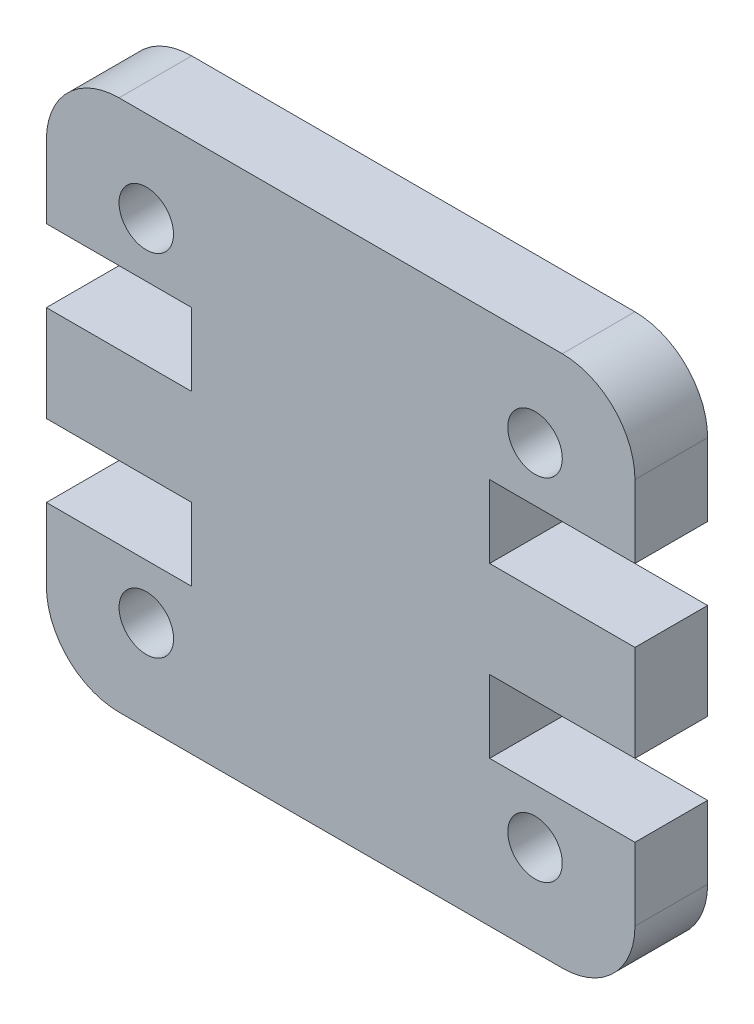
ISO-10303-21;
HEADER;
FILE_DESCRIPTION(('STEP AP214'),'2;1');
FILE_NAME('part.step','',(''),(''),'','','');
FILE_SCHEMA(('AUTOMOTIVE_DESIGN { 1 0 10303 214 1 1 1 1 }'));
ENDSEC;
DATA;
#1=APPLICATION_CONTEXT('core data for automotive mechanical design processes');
#2=APPLICATION_PROTOCOL_DEFINITION('international standard','automotive_design',2000,#1);
#3=PRODUCT_CONTEXT('',#1,'mechanical');
#4=PRODUCT('Part','Part','',(#3));
#5=PRODUCT_RELATED_PRODUCT_CATEGORY('part','',(#4));
#6=PRODUCT_DEFINITION_FORMATION('','',#4);
#7=PRODUCT_DEFINITION_CONTEXT('part definition',#1,'design');
#8=PRODUCT_DEFINITION('design','',#6,#7);
#9=PRODUCT_DEFINITION_SHAPE('','',#8);
#10=(LENGTH_UNIT() NAMED_UNIT(*) SI_UNIT(.MILLI.,.METRE.));
#11=(NAMED_UNIT(*) PLANE_ANGLE_UNIT() SI_UNIT($,.RADIAN.));
#12=(NAMED_UNIT(*) SI_UNIT($,.STERADIAN.) SOLID_ANGLE_UNIT());
#13=UNCERTAINTY_MEASURE_WITH_UNIT(LENGTH_MEASURE(1.E-05),#10,'distance_accuracy_value','');
#14=(GEOMETRIC_REPRESENTATION_CONTEXT(3) GLOBAL_UNCERTAINTY_ASSIGNED_CONTEXT((#13)) GLOBAL_UNIT_ASSIGNED_CONTEXT((#10,
#11,#12)) REPRESENTATION_CONTEXT('',''));
#15=CARTESIAN_POINT('',(0.,0.,0.));
#16=DIRECTION('',(0.,0.,1.));
#17=DIRECTION('',(1.,0.,0.));
#18=AXIS2_PLACEMENT_3D('',#15,#16,#17);
#19=CARTESIAN_POINT('',(14.2,2.,2.));
#20=DIRECTION('',(0.,0.,-1.));
#21=DIRECTION('',(-1.,0.,0.));
#22=AXIS2_PLACEMENT_3D('',#19,#20,#21);
#23=PLANE('',#22);
#24=CARTESIAN_POINT('',(13.4499999999986,12.1450000000001,2.));
#25=DIRECTION('',(0.,0.,1.));
#26=DIRECTION('',(1.,0.,0.));
#27=AXIS2_PLACEMENT_3D('',#24,#25,#26);
#28=CIRCLE('',#27,0.750000000000002);
#29=CARTESIAN_POINT('',(14.1999999999986,12.1450000000001,2.));
#30=VERTEX_POINT('',#29);
#31=EDGE_CURVE('E448',#30,#30,#28,.T.);
#32=ORIENTED_EDGE('',*,*,#31,.F.);
#33=EDGE_LOOP('',(#32));
#34=FACE_BOUND('',#33,.T.);
#35=CARTESIAN_POINT('',(13.4499999999986,2.4999999999999,2.));
#36=DIRECTION('',(0.,0.,1.));
#37=DIRECTION('',(-1.,0.,0.));
#38=AXIS2_PLACEMENT_3D('',#35,#36,#37);
#39=CIRCLE('',#38,0.750000000000002);
#40=CARTESIAN_POINT('',(12.6999999999986,2.4999999999999,2.));
#41=VERTEX_POINT('',#40);
#42=EDGE_CURVE('E230',#41,#41,#39,.T.);
#43=ORIENTED_EDGE('',*,*,#42,.F.);
#44=EDGE_LOOP('',(#43));
#45=FACE_BOUND('',#44,.T.);
#46=CARTESIAN_POINT('',(14.2,2.,2.));
#47=DIRECTION('',(0.,0.,1.));
#48=DIRECTION('',(-1.,0.,0.));
#49=AXIS2_PLACEMENT_3D('',#46,#47,#48);
#50=CIRCLE('',#49,2.);
#51=CARTESIAN_POINT('',(14.2,0.,2.));
#52=VERTEX_POINT('',#51);
#53=CARTESIAN_POINT('',(16.2,2.,2.));
#54=VERTEX_POINT('',#53);
#55=EDGE_CURVE('E273',#52,#54,#50,.T.);
#56=ORIENTED_EDGE('',*,*,#55,.T.);
#57=DIRECTION('',(0.,1.,0.));
#58=VECTOR('',#57,1.);
#59=CARTESIAN_POINT('',(16.2,4.,2.));
#60=LINE('',#59,#58);
#61=CARTESIAN_POINT('',(16.2,4.,2.));
#62=VERTEX_POINT('',#61);
#63=EDGE_CURVE('E141',#54,#62,#60,.T.);
#64=ORIENTED_EDGE('',*,*,#63,.T.);
#65=DIRECTION('',(-1.,0.,0.));
#66=VECTOR('',#65,1.);
#67=CARTESIAN_POINT('',(12.2,4.,2.));
#68=LINE('',#67,#66);
#69=CARTESIAN_POINT('',(12.2,4.,2.));
#70=VERTEX_POINT('',#69);
#71=EDGE_CURVE('E336',#62,#70,#68,.T.);
#72=ORIENTED_EDGE('',*,*,#71,.T.);
#73=DIRECTION('',(0.,1.,0.));
#74=VECTOR('',#73,1.);
#75=CARTESIAN_POINT('',(12.2,6.00000000000001,2.));
#76=LINE('',#75,#74);
#77=CARTESIAN_POINT('',(12.2,6.00000000000001,2.));
#78=VERTEX_POINT('',#77);
#79=EDGE_CURVE('E355',#70,#78,#76,.T.);
#80=ORIENTED_EDGE('',*,*,#79,.T.);
#81=DIRECTION('',(1.,0.,0.));
#82=VECTOR('',#81,1.);
#83=CARTESIAN_POINT('',(16.2,6.00000000000001,2.));
#84=LINE('',#83,#82);
#85=CARTESIAN_POINT('',(16.2,6.00000000000001,2.));
#86=VERTEX_POINT('',#85);
#87=EDGE_CURVE('E352',#78,#86,#84,.T.);
#88=ORIENTED_EDGE('',*,*,#87,.T.);
#89=DIRECTION('',(0.,1.,0.));
#90=VECTOR('',#89,1.);
#91=CARTESIAN_POINT('',(16.2,8.64499999999999,2.));
#92=LINE('',#91,#90);
#93=CARTESIAN_POINT('',(16.2,8.64499999999999,2.));
#94=VERTEX_POINT('',#93);
#95=EDGE_CURVE('E354',#86,#94,#92,.T.);
#96=ORIENTED_EDGE('',*,*,#95,.T.);
#97=DIRECTION('',(-1.,0.,0.));
#98=VECTOR('',#97,1.);
#99=CARTESIAN_POINT('',(16.2,8.64499999999999,2.));
#100=LINE('',#99,#98);
#101=CARTESIAN_POINT('',(12.2,8.64499999999999,2.));
#102=VERTEX_POINT('',#101);
#103=EDGE_CURVE('E357',#94,#102,#100,.T.);
#104=ORIENTED_EDGE('',*,*,#103,.T.);
#105=DIRECTION('',(0.,1.,0.));
#106=VECTOR('',#105,1.);
#107=CARTESIAN_POINT('',(12.2,8.64499999999999,2.));
#108=LINE('',#107,#106);
#109=CARTESIAN_POINT('',(12.2,10.645,2.));
#110=VERTEX_POINT('',#109);
#111=EDGE_CURVE('E363',#102,#110,#108,.T.);
#112=ORIENTED_EDGE('',*,*,#111,.T.);
#113=DIRECTION('',(1.,0.,0.));
#114=VECTOR('',#113,1.);
#115=CARTESIAN_POINT('',(12.2,10.645,2.));
#116=LINE('',#115,#114);
#117=CARTESIAN_POINT('',(16.2,10.645,2.));
#118=VERTEX_POINT('',#117);
#119=EDGE_CURVE('E365',#110,#118,#116,.T.);
#120=ORIENTED_EDGE('',*,*,#119,.T.);
#121=DIRECTION('',(0.,1.,0.));
#122=VECTOR('',#121,1.);
#123=CARTESIAN_POINT('',(16.2,10.645,2.));
#124=LINE('',#123,#122);
#125=CARTESIAN_POINT('',(16.2,12.645,2.));
#126=VERTEX_POINT('',#125);
#127=EDGE_CURVE('E367',#118,#126,#124,.T.);
#128=ORIENTED_EDGE('',*,*,#127,.T.);
#129=CARTESIAN_POINT('',(14.2,12.645,2.));
#130=DIRECTION('',(0.,0.,1.));
#131=DIRECTION('',(1.,0.,0.));
#132=AXIS2_PLACEMENT_3D('',#129,#130,#131);
#133=CIRCLE('',#132,2.);
#134=CARTESIAN_POINT('',(14.2,14.645,2.));
#135=VERTEX_POINT('',#134);
#136=EDGE_CURVE('E369',#126,#135,#133,.T.);
#137=ORIENTED_EDGE('',*,*,#136,.T.);
#138=DIRECTION('',(-1.,0.,0.));
#139=VECTOR('',#138,1.);
#140=CARTESIAN_POINT('',(2.,14.645,2.));
#141=LINE('',#140,#139);
#142=CARTESIAN_POINT('',(2.,14.645,2.));
#143=VERTEX_POINT('',#142);
#144=EDGE_CURVE('E371',#135,#143,#141,.T.);
#145=ORIENTED_EDGE('',*,*,#144,.T.);
#146=CARTESIAN_POINT('',(2.,12.645,2.));
#147=DIRECTION('',(0.,0.,1.));
#148=DIRECTION('',(-1.,0.,0.));
#149=AXIS2_PLACEMENT_3D('',#146,#147,#148);
#150=CIRCLE('',#149,2.);
#151=CARTESIAN_POINT('',(0.,12.645,2.));
#152=VERTEX_POINT('',#151);
#153=EDGE_CURVE('E373',#143,#152,#150,.T.);
#154=ORIENTED_EDGE('',*,*,#153,.T.);
#155=DIRECTION('',(0.,-1.,0.));
#156=VECTOR('',#155,1.);
#157=CARTESIAN_POINT('',(0.,10.645,2.));
#158=LINE('',#157,#156);
#159=CARTESIAN_POINT('',(0.,10.645,2.));
#160=VERTEX_POINT('',#159);
#161=EDGE_CURVE('E375',#152,#160,#158,.T.);
#162=ORIENTED_EDGE('',*,*,#161,.T.);
#163=DIRECTION('',(1.,0.,0.));
#164=VECTOR('',#163,1.);
#165=CARTESIAN_POINT('',(4.,10.645,2.));
#166=LINE('',#165,#164);
#167=CARTESIAN_POINT('',(4.,10.645,2.));
#168=VERTEX_POINT('',#167);
#169=EDGE_CURVE('E377',#160,#168,#166,.T.);
#170=ORIENTED_EDGE('',*,*,#169,.T.);
#171=DIRECTION('',(0.,-1.,0.));
#172=VECTOR('',#171,1.);
#173=CARTESIAN_POINT('',(4.,8.64499999999999,2.));
#174=LINE('',#173,#172);
#175=CARTESIAN_POINT('',(4.,8.64499999999999,2.));
#176=VERTEX_POINT('',#175);
#177=EDGE_CURVE('E379',#168,#176,#174,.T.);
#178=ORIENTED_EDGE('',*,*,#177,.T.);
#179=DIRECTION('',(-1.,0.,0.));
#180=VECTOR('',#179,1.);
#181=CARTESIAN_POINT('',(0.,8.64499999999999,2.));
#182=LINE('',#181,#180);
#183=CARTESIAN_POINT('',(0.,8.64499999999999,2.));
#184=VERTEX_POINT('',#183);
#185=EDGE_CURVE('E381',#176,#184,#182,.T.);
#186=ORIENTED_EDGE('',*,*,#185,.T.);
#187=DIRECTION('',(0.,-1.,0.));
#188=VECTOR('',#187,1.);
#189=CARTESIAN_POINT('',(0.,8.64499999999999,2.));
#190=LINE('',#189,#188);
#191=CARTESIAN_POINT('',(0.,6.00000000000003,2.));
#192=VERTEX_POINT('',#191);
#193=EDGE_CURVE('E383',#184,#192,#190,.T.);
#194=ORIENTED_EDGE('',*,*,#193,.T.);
#195=DIRECTION('',(1.,0.,0.));
#196=VECTOR('',#195,1.);
#197=CARTESIAN_POINT('',(0.,6.00000000000003,2.));
#198=LINE('',#197,#196);
#199=CARTESIAN_POINT('',(4.00000000000003,6.00000000000003,2.));
#200=VERTEX_POINT('',#199);
#201=EDGE_CURVE('E385',#192,#200,#198,.T.);
#202=ORIENTED_EDGE('',*,*,#201,.T.);
#203=DIRECTION('',(0.,-1.,0.));
#204=VECTOR('',#203,1.);
#205=CARTESIAN_POINT('',(4.00000000000003,6.00000000000003,2.));
#206=LINE('',#205,#204);
#207=CARTESIAN_POINT('',(4.00000000000003,4.00000000000002,2.));
#208=VERTEX_POINT('',#207);
#209=EDGE_CURVE('E387',#200,#208,#206,.T.);
#210=ORIENTED_EDGE('',*,*,#209,.T.);
#211=DIRECTION('',(-1.,0.,0.));
#212=VECTOR('',#211,1.);
#213=CARTESIAN_POINT('',(4.00000000000003,4.00000000000002,2.));
#214=LINE('',#213,#212);
#215=CARTESIAN_POINT('',(0.,4.00000000000003,2.));
#216=VERTEX_POINT('',#215);
#217=EDGE_CURVE('E208',#208,#216,#214,.T.);
#218=ORIENTED_EDGE('',*,*,#217,.T.);
#219=DIRECTION('',(0.,-1.,0.));
#220=VECTOR('',#219,1.);
#221=CARTESIAN_POINT('',(0.,4.00000000000003,2.));
#222=LINE('',#221,#220);
#223=CARTESIAN_POINT('',(0.,2.00000000000003,2.));
#224=VERTEX_POINT('',#223);
#225=EDGE_CURVE('E202',#216,#224,#222,.T.);
#226=ORIENTED_EDGE('',*,*,#225,.T.);
#227=CARTESIAN_POINT('',(2.,2.,2.));
#228=DIRECTION('',(0.,0.,1.));
#229=DIRECTION('',(1.,0.,0.));
#230=AXIS2_PLACEMENT_3D('',#227,#228,#229);
#231=CIRCLE('',#230,2.);
#232=CARTESIAN_POINT('',(2.,0.,2.));
#233=VERTEX_POINT('',#232);
#234=EDGE_CURVE('E206',#224,#233,#231,.T.);
#235=ORIENTED_EDGE('',*,*,#234,.T.);
#236=DIRECTION('',(1.,0.,0.));
#237=VECTOR('',#236,1.);
#238=CARTESIAN_POINT('',(2.,0.,2.));
#239=LINE('',#238,#237);
#240=EDGE_CURVE('E50',#233,#52,#239,.T.);
#241=ORIENTED_EDGE('',*,*,#240,.T.);
#242=EDGE_LOOP('',(#56,#64,#72,#80,#88,#96,#104,#112,#120,#128,#137,#145,#154,#162,#170,#178,
#186,#194,#202,#210,#218,#226,#235,#241));
#243=FACE_BOUND('',#242,.T.);
#244=CARTESIAN_POINT('',(2.75000000000139,12.1450000000001,2.));
#245=DIRECTION('',(0.,0.,1.));
#246=DIRECTION('',(-1.,0.,0.));
#247=AXIS2_PLACEMENT_3D('',#244,#245,#246);
#248=CIRCLE('',#247,0.750000000000001);
#249=CARTESIAN_POINT('',(2.00000000000139,12.1450000000001,2.));
#250=VERTEX_POINT('',#249);
#251=EDGE_CURVE('E454',#250,#250,#248,.T.);
#252=ORIENTED_EDGE('',*,*,#251,.F.);
#253=EDGE_LOOP('',(#252));
#254=FACE_BOUND('',#253,.T.);
#255=CARTESIAN_POINT('',(2.75000000000139,2.4999999999999,2.));
#256=DIRECTION('',(0.,0.,1.));
#257=DIRECTION('',(1.,0.,0.));
#258=AXIS2_PLACEMENT_3D('',#255,#256,#257);
#259=CIRCLE('',#258,0.75);
#260=CARTESIAN_POINT('',(3.50000000000139,2.4999999999999,2.));
#261=VERTEX_POINT('',#260);
#262=EDGE_CURVE('E439',#261,#261,#259,.T.);
#263=ORIENTED_EDGE('',*,*,#262,.F.);
#264=EDGE_LOOP('',(#263));
#265=FACE_BOUND('',#264,.T.);
#266=ADVANCED_FACE('F33',(#34,#45,#243,#254,#265),#23,.F.);
#267=CARTESIAN_POINT('',(14.2,2.,0.));
#268=DIRECTION('',(0.,0.,-1.));
#269=DIRECTION('',(-1.,0.,0.));
#270=AXIS2_PLACEMENT_3D('',#267,#268,#269);
#271=PLANE('',#270);
#272=CARTESIAN_POINT('',(13.4499999999986,12.1450000000001,0.));
#273=DIRECTION('',(0.,0.,1.));
#274=DIRECTION('',(1.,0.,0.));
#275=AXIS2_PLACEMENT_3D('',#272,#273,#274);
#276=CIRCLE('',#275,0.750000000000002);
#277=CARTESIAN_POINT('',(14.1999999999986,12.1450000000001,0.));
#278=VERTEX_POINT('',#277);
#279=EDGE_CURVE('E445',#278,#278,#276,.T.);
#280=ORIENTED_EDGE('',*,*,#279,.T.);
#281=EDGE_LOOP('',(#280));
#282=FACE_BOUND('',#281,.T.);
#283=CARTESIAN_POINT('',(13.4499999999986,2.4999999999999,0.));
#284=DIRECTION('',(0.,0.,1.));
#285=DIRECTION('',(-1.,0.,0.));
#286=AXIS2_PLACEMENT_3D('',#283,#284,#285);
#287=CIRCLE('',#286,0.750000000000002);
#288=CARTESIAN_POINT('',(12.6999999999986,2.4999999999999,0.));
#289=VERTEX_POINT('',#288);
#290=EDGE_CURVE('E457',#289,#289,#287,.T.);
#291=ORIENTED_EDGE('',*,*,#290,.T.);
#292=EDGE_LOOP('',(#291));
#293=FACE_BOUND('',#292,.T.);
#294=CARTESIAN_POINT('',(14.2,2.,0.));
#295=DIRECTION('',(0.,0.,1.));
#296=DIRECTION('',(-1.,0.,0.));
#297=AXIS2_PLACEMENT_3D('',#294,#295,#296);
#298=CIRCLE('',#297,2.);
#299=CARTESIAN_POINT('',(14.2,0.,0.));
#300=VERTEX_POINT('',#299);
#301=CARTESIAN_POINT('',(16.2,2.,0.));
#302=VERTEX_POINT('',#301);
#303=EDGE_CURVE('E226',#300,#302,#298,.T.);
#304=ORIENTED_EDGE('',*,*,#303,.F.);
#305=DIRECTION('',(1.,0.,0.));
#306=VECTOR('',#305,1.);
#307=CARTESIAN_POINT('',(2.,0.,0.));
#308=LINE('',#307,#306);
#309=CARTESIAN_POINT('',(2.,0.,0.));
#310=VERTEX_POINT('',#309);
#311=EDGE_CURVE('E133',#310,#300,#308,.T.);
#312=ORIENTED_EDGE('',*,*,#311,.F.);
#313=CARTESIAN_POINT('',(2.,2.,0.));
#314=DIRECTION('',(0.,0.,1.));
#315=DIRECTION('',(1.,0.,0.));
#316=AXIS2_PLACEMENT_3D('',#313,#314,#315);
#317=CIRCLE('',#316,2.);
#318=CARTESIAN_POINT('',(0.,2.00000000000003,0.));
#319=VERTEX_POINT('',#318);
#320=EDGE_CURVE('E127',#319,#310,#317,.T.);
#321=ORIENTED_EDGE('',*,*,#320,.F.);
#322=DIRECTION('',(0.,-1.,0.));
#323=VECTOR('',#322,1.);
#324=CARTESIAN_POINT('',(0.,4.00000000000003,0.));
#325=LINE('',#324,#323);
#326=CARTESIAN_POINT('',(0.,4.00000000000003,0.));
#327=VERTEX_POINT('',#326);
#328=EDGE_CURVE('E216',#327,#319,#325,.T.);
#329=ORIENTED_EDGE('',*,*,#328,.F.);
#330=DIRECTION('',(-1.,0.,0.));
#331=VECTOR('',#330,1.);
#332=CARTESIAN_POINT('',(4.00000000000003,4.00000000000002,0.));
#333=LINE('',#332,#331);
#334=CARTESIAN_POINT('',(4.00000000000003,4.00000000000002,0.));
#335=VERTEX_POINT('',#334);
#336=EDGE_CURVE('E268',#335,#327,#333,.T.);
#337=ORIENTED_EDGE('',*,*,#336,.F.);
#338=DIRECTION('',(0.,-1.,0.));
#339=VECTOR('',#338,1.);
#340=CARTESIAN_POINT('',(4.00000000000003,6.00000000000003,0.));
#341=LINE('',#340,#339);
#342=CARTESIAN_POINT('',(4.00000000000003,6.00000000000003,0.));
#343=VERTEX_POINT('',#342);
#344=EDGE_CURVE('E266',#343,#335,#341,.T.);
#345=ORIENTED_EDGE('',*,*,#344,.F.);
#346=DIRECTION('',(1.,0.,0.));
#347=VECTOR('',#346,1.);
#348=CARTESIAN_POINT('',(0.,6.00000000000003,0.));
#349=LINE('',#348,#347);
#350=CARTESIAN_POINT('',(0.,6.00000000000003,0.));
#351=VERTEX_POINT('',#350);
#352=EDGE_CURVE('E264',#351,#343,#349,.T.);
#353=ORIENTED_EDGE('',*,*,#352,.F.);
#354=DIRECTION('',(0.,-1.,0.));
#355=VECTOR('',#354,1.);
#356=CARTESIAN_POINT('',(0.,8.64499999999999,0.));
#357=LINE('',#356,#355);
#358=CARTESIAN_POINT('',(0.,8.64499999999999,0.));
#359=VERTEX_POINT('',#358);
#360=EDGE_CURVE('E262',#359,#351,#357,.T.);
#361=ORIENTED_EDGE('',*,*,#360,.F.);
#362=DIRECTION('',(-1.,0.,0.));
#363=VECTOR('',#362,1.);
#364=CARTESIAN_POINT('',(0.,8.64499999999999,0.));
#365=LINE('',#364,#363);
#366=CARTESIAN_POINT('',(4.,8.64499999999999,0.));
#367=VERTEX_POINT('',#366);
#368=EDGE_CURVE('E260',#367,#359,#365,.T.);
#369=ORIENTED_EDGE('',*,*,#368,.F.);
#370=DIRECTION('',(0.,-1.,0.));
#371=VECTOR('',#370,1.);
#372=CARTESIAN_POINT('',(4.,8.64499999999999,0.));
#373=LINE('',#372,#371);
#374=CARTESIAN_POINT('',(4.,10.645,0.));
#375=VERTEX_POINT('',#374);
#376=EDGE_CURVE('E258',#375,#367,#373,.T.);
#377=ORIENTED_EDGE('',*,*,#376,.F.);
#378=DIRECTION('',(1.,0.,0.));
#379=VECTOR('',#378,1.);
#380=CARTESIAN_POINT('',(4.,10.645,0.));
#381=LINE('',#380,#379);
#382=CARTESIAN_POINT('',(0.,10.645,0.));
#383=VERTEX_POINT('',#382);
#384=EDGE_CURVE('E256',#383,#375,#381,.T.);
#385=ORIENTED_EDGE('',*,*,#384,.F.);
#386=DIRECTION('',(0.,-1.,0.));
#387=VECTOR('',#386,1.);
#388=CARTESIAN_POINT('',(0.,10.645,0.));
#389=LINE('',#388,#387);
#390=CARTESIAN_POINT('',(0.,12.645,0.));
#391=VERTEX_POINT('',#390);
#392=EDGE_CURVE('E254',#391,#383,#389,.T.);
#393=ORIENTED_EDGE('',*,*,#392,.F.);
#394=CARTESIAN_POINT('',(2.,12.645,0.));
#395=DIRECTION('',(0.,0.,1.));
#396=DIRECTION('',(-1.,0.,0.));
#397=AXIS2_PLACEMENT_3D('',#394,#395,#396);
#398=CIRCLE('',#397,2.);
#399=CARTESIAN_POINT('',(2.,14.645,0.));
#400=VERTEX_POINT('',#399);
#401=EDGE_CURVE('E252',#400,#391,#398,.T.);
#402=ORIENTED_EDGE('',*,*,#401,.F.);
#403=DIRECTION('',(-1.,0.,0.));
#404=VECTOR('',#403,1.);
#405=CARTESIAN_POINT('',(2.,14.645,0.));
#406=LINE('',#405,#404);
#407=CARTESIAN_POINT('',(14.2,14.645,0.));
#408=VERTEX_POINT('',#407);
#409=EDGE_CURVE('E250',#408,#400,#406,.T.);
#410=ORIENTED_EDGE('',*,*,#409,.F.);
#411=CARTESIAN_POINT('',(14.2,12.645,0.));
#412=DIRECTION('',(0.,0.,1.));
#413=DIRECTION('',(1.,0.,0.));
#414=AXIS2_PLACEMENT_3D('',#411,#412,#413);
#415=CIRCLE('',#414,2.);
#416=CARTESIAN_POINT('',(16.2,12.645,0.));
#417=VERTEX_POINT('',#416);
#418=EDGE_CURVE('E248',#417,#408,#415,.T.);
#419=ORIENTED_EDGE('',*,*,#418,.F.);
#420=DIRECTION('',(0.,1.,0.));
#421=VECTOR('',#420,1.);
#422=CARTESIAN_POINT('',(16.2,10.645,0.));
#423=LINE('',#422,#421);
#424=CARTESIAN_POINT('',(16.2,10.645,0.));
#425=VERTEX_POINT('',#424);
#426=EDGE_CURVE('E246',#425,#417,#423,.T.);
#427=ORIENTED_EDGE('',*,*,#426,.F.);
#428=DIRECTION('',(1.,0.,0.));
#429=VECTOR('',#428,1.);
#430=CARTESIAN_POINT('',(12.2,10.645,0.));
#431=LINE('',#430,#429);
#432=CARTESIAN_POINT('',(12.2,10.645,0.));
#433=VERTEX_POINT('',#432);
#434=EDGE_CURVE('E244',#433,#425,#431,.T.);
#435=ORIENTED_EDGE('',*,*,#434,.F.);
#436=DIRECTION('',(0.,1.,0.));
#437=VECTOR('',#436,1.);
#438=CARTESIAN_POINT('',(12.2,8.64499999999999,0.));
#439=LINE('',#438,#437);
#440=CARTESIAN_POINT('',(12.2,8.64499999999999,0.));
#441=VERTEX_POINT('',#440);
#442=EDGE_CURVE('E242',#441,#433,#439,.T.);
#443=ORIENTED_EDGE('',*,*,#442,.F.);
#444=DIRECTION('',(-1.,0.,0.));
#445=VECTOR('',#444,1.);
#446=CARTESIAN_POINT('',(16.2,8.64499999999999,0.));
#447=LINE('',#446,#445);
#448=CARTESIAN_POINT('',(16.2,8.64499999999999,0.));
#449=VERTEX_POINT('',#448);
#450=EDGE_CURVE('E240',#449,#441,#447,.T.);
#451=ORIENTED_EDGE('',*,*,#450,.F.);
#452=DIRECTION('',(0.,1.,0.));
#453=VECTOR('',#452,1.);
#454=CARTESIAN_POINT('',(16.2,8.64499999999999,0.));
#455=LINE('',#454,#453);
#456=CARTESIAN_POINT('',(16.2,6.00000000000001,0.));
#457=VERTEX_POINT('',#456);
#458=EDGE_CURVE('E238',#457,#449,#455,.T.);
#459=ORIENTED_EDGE('',*,*,#458,.F.);
#460=DIRECTION('',(1.,0.,0.));
#461=VECTOR('',#460,1.);
#462=CARTESIAN_POINT('',(16.2,6.00000000000001,0.));
#463=LINE('',#462,#461);
#464=CARTESIAN_POINT('',(12.2,6.00000000000001,0.));
#465=VERTEX_POINT('',#464);
#466=EDGE_CURVE('E236',#465,#457,#463,.T.);
#467=ORIENTED_EDGE('',*,*,#466,.F.);
#468=DIRECTION('',(0.,1.,0.));
#469=VECTOR('',#468,1.);
#470=CARTESIAN_POINT('',(12.2,6.00000000000001,0.));
#471=LINE('',#470,#469);
#472=CARTESIAN_POINT('',(12.2,4.,0.));
#473=VERTEX_POINT('',#472);
#474=EDGE_CURVE('E234',#473,#465,#471,.T.);
#475=ORIENTED_EDGE('',*,*,#474,.F.);
#476=DIRECTION('',(-1.,0.,0.));
#477=VECTOR('',#476,1.);
#478=CARTESIAN_POINT('',(12.2,4.,0.));
#479=LINE('',#478,#477);
#480=CARTESIAN_POINT('',(16.2,4.,0.));
#481=VERTEX_POINT('',#480);
#482=EDGE_CURVE('E232',#481,#473,#479,.T.);
#483=ORIENTED_EDGE('',*,*,#482,.F.);
#484=DIRECTION('',(0.,1.,0.));
#485=VECTOR('',#484,1.);
#486=CARTESIAN_POINT('',(16.2,4.,0.));
#487=LINE('',#486,#485);
#488=EDGE_CURVE('E229',#302,#481,#487,.T.);
#489=ORIENTED_EDGE('',*,*,#488,.F.);
#490=EDGE_LOOP('',(#304,#312,#321,#329,#337,#345,#353,#361,#369,#377,#385,#393,#402,#410,#419,
#427,#435,#443,#451,#459,#467,#475,#483,#489));
#491=FACE_BOUND('',#490,.T.);
#492=CARTESIAN_POINT('',(2.75000000000139,12.1450000000001,0.));
#493=DIRECTION('',(0.,0.,1.));
#494=DIRECTION('',(-1.,0.,0.));
#495=AXIS2_PLACEMENT_3D('',#492,#493,#494);
#496=CIRCLE('',#495,0.750000000000001);
#497=CARTESIAN_POINT('',(2.00000000000139,12.1450000000001,0.));
#498=VERTEX_POINT('',#497);
#499=EDGE_CURVE('E451',#498,#498,#496,.T.);
#500=ORIENTED_EDGE('',*,*,#499,.T.);
#501=EDGE_LOOP('',(#500));
#502=FACE_BOUND('',#501,.T.);
#503=CARTESIAN_POINT('',(2.75000000000139,2.4999999999999,0.));
#504=DIRECTION('',(0.,0.,1.));
#505=DIRECTION('',(1.,0.,0.));
#506=AXIS2_PLACEMENT_3D('',#503,#504,#505);
#507=CIRCLE('',#506,0.75);
#508=CARTESIAN_POINT('',(3.50000000000139,2.4999999999999,0.));
#509=VERTEX_POINT('',#508);
#510=EDGE_CURVE('E442',#509,#509,#507,.T.);
#511=ORIENTED_EDGE('',*,*,#510,.T.);
#512=EDGE_LOOP('',(#511));
#513=FACE_BOUND('',#512,.T.);
#514=ADVANCED_FACE('F340',(#282,#293,#491,#502,#513),#271,.T.);
#515=CARTESIAN_POINT('',(14.2,2.,2.));
#516=DIRECTION('',(0.,0.,-1.));
#517=DIRECTION('',(-1.,0.,0.));
#518=AXIS2_PLACEMENT_3D('',#515,#516,#517);
#519=CYLINDRICAL_SURFACE('',#518,2.);
#520=ORIENTED_EDGE('',*,*,#303,.T.);
#521=DIRECTION('',(0.,0.,-1.));
#522=VECTOR('',#521,1.);
#523=CARTESIAN_POINT('',(16.2,2.,2.));
#524=LINE('',#523,#522);
#525=EDGE_CURVE('E11',#54,#302,#524,.T.);
#526=ORIENTED_EDGE('',*,*,#525,.F.);
#527=ORIENTED_EDGE('',*,*,#55,.F.);
#528=DIRECTION('',(0.,0.,-1.));
#529=VECTOR('',#528,1.);
#530=CARTESIAN_POINT('',(14.2,0.,2.));
#531=LINE('',#530,#529);
#532=EDGE_CURVE('E222',#52,#300,#531,.T.);
#533=ORIENTED_EDGE('',*,*,#532,.T.);
#534=EDGE_LOOP('',(#520,#526,#527,#533));
#535=FACE_BOUND('',#534,.T.);
#536=ADVANCED_FACE('F35',(#535),#519,.T.);
#537=CARTESIAN_POINT('',(16.2,4.,2.));
#538=DIRECTION('',(-1.,0.,0.));
#539=DIRECTION('',(0.,0.,1.));
#540=AXIS2_PLACEMENT_3D('',#537,#538,#539);
#541=PLANE('',#540);
#542=ORIENTED_EDGE('',*,*,#488,.T.);
#543=DIRECTION('',(0.,0.,-1.));
#544=VECTOR('',#543,1.);
#545=CARTESIAN_POINT('',(16.2,4.,2.));
#546=LINE('',#545,#544);
#547=EDGE_CURVE('E42',#62,#481,#546,.T.);
#548=ORIENTED_EDGE('',*,*,#547,.F.);
#549=ORIENTED_EDGE('',*,*,#63,.F.);
#550=ORIENTED_EDGE('',*,*,#525,.T.);
#551=EDGE_LOOP('',(#542,#548,#549,#550));
#552=FACE_BOUND('',#551,.T.);
#553=ADVANCED_FACE('F686',(#552),#541,.F.);
#554=CARTESIAN_POINT('',(12.2,4.,2.));
#555=DIRECTION('',(0.,-1.,0.));
#556=DIRECTION('',(0.,0.,-1.));
#557=AXIS2_PLACEMENT_3D('',#554,#555,#556);
#558=PLANE('',#557);
#559=ORIENTED_EDGE('',*,*,#482,.T.);
#560=DIRECTION('',(0.,0.,-1.));
#561=VECTOR('',#560,1.);
#562=CARTESIAN_POINT('',(12.2,4.,2.));
#563=LINE('',#562,#561);
#564=EDGE_CURVE('E328',#70,#473,#563,.T.);
#565=ORIENTED_EDGE('',*,*,#564,.F.);
#566=ORIENTED_EDGE('',*,*,#71,.F.);
#567=ORIENTED_EDGE('',*,*,#547,.T.);
#568=EDGE_LOOP('',(#559,#565,#566,#567));
#569=FACE_BOUND('',#568,.T.);
#570=ADVANCED_FACE('F334',(#569),#558,.F.);
#571=CARTESIAN_POINT('',(12.2,6.00000000000001,2.));
#572=DIRECTION('',(-1.,0.,0.));
#573=DIRECTION('',(0.,-1.,0.));
#574=AXIS2_PLACEMENT_3D('',#571,#572,#573);
#575=PLANE('',#574);
#576=ORIENTED_EDGE('',*,*,#474,.T.);
#577=DIRECTION('',(0.,0.,-1.));
#578=VECTOR('',#577,1.);
#579=CARTESIAN_POINT('',(12.2,6.00000000000001,2.));
#580=LINE('',#579,#578);
#581=EDGE_CURVE('E325',#78,#465,#580,.T.);
#582=ORIENTED_EDGE('',*,*,#581,.F.);
#583=ORIENTED_EDGE('',*,*,#79,.F.);
#584=ORIENTED_EDGE('',*,*,#564,.T.);
#585=EDGE_LOOP('',(#576,#582,#583,#584));
#586=FACE_BOUND('',#585,.T.);
#587=ADVANCED_FACE('F346',(#586),#575,.F.);
#588=CARTESIAN_POINT('',(16.2,6.00000000000001,2.));
#589=DIRECTION('',(0.,1.,0.));
#590=DIRECTION('',(0.,0.,1.));
#591=AXIS2_PLACEMENT_3D('',#588,#589,#590);
#592=PLANE('',#591);
#593=ORIENTED_EDGE('',*,*,#466,.T.);
#594=DIRECTION('',(0.,0.,-1.));
#595=VECTOR('',#594,1.);
#596=CARTESIAN_POINT('',(16.2,6.00000000000001,2.));
#597=LINE('',#596,#595);
#598=EDGE_CURVE('E322',#86,#457,#597,.T.);
#599=ORIENTED_EDGE('',*,*,#598,.F.);
#600=ORIENTED_EDGE('',*,*,#87,.F.);
#601=ORIENTED_EDGE('',*,*,#581,.T.);
#602=EDGE_LOOP('',(#593,#599,#600,#601));
#603=FACE_BOUND('',#602,.T.);
#604=ADVANCED_FACE('F350',(#603),#592,.F.);
#605=CARTESIAN_POINT('',(16.2,8.64499999999999,2.));
#606=DIRECTION('',(-1.,0.,0.));
#607=DIRECTION('',(0.,0.,1.));
#608=AXIS2_PLACEMENT_3D('',#605,#606,#607);
#609=PLANE('',#608);
#610=ORIENTED_EDGE('',*,*,#458,.T.);
#611=DIRECTION('',(0.,0.,-1.));
#612=VECTOR('',#611,1.);
#613=CARTESIAN_POINT('',(16.2,8.64499999999999,2.));
#614=LINE('',#613,#612);
#615=EDGE_CURVE('E319',#94,#449,#614,.T.);
#616=ORIENTED_EDGE('',*,*,#615,.F.);
#617=ORIENTED_EDGE('',*,*,#95,.F.);
#618=ORIENTED_EDGE('',*,*,#598,.T.);
#619=EDGE_LOOP('',(#610,#616,#617,#618));
#620=FACE_BOUND('',#619,.T.);
#621=ADVANCED_FACE('F651',(#620),#609,.F.);
#622=CARTESIAN_POINT('',(16.2,8.64499999999999,2.));
#623=DIRECTION('',(0.,-1.,0.));
#624=DIRECTION('',(0.,0.,-1.));
#625=AXIS2_PLACEMENT_3D('',#622,#623,#624);
#626=PLANE('',#625);
#627=ORIENTED_EDGE('',*,*,#450,.T.);
#628=DIRECTION('',(0.,0.,-1.));
#629=VECTOR('',#628,1.);
#630=CARTESIAN_POINT('',(12.2,8.64499999999999,2.));
#631=LINE('',#630,#629);
#632=EDGE_CURVE('E316',#102,#441,#631,.T.);
#633=ORIENTED_EDGE('',*,*,#632,.F.);
#634=ORIENTED_EDGE('',*,*,#103,.F.);
#635=ORIENTED_EDGE('',*,*,#615,.T.);
#636=EDGE_LOOP('',(#627,#633,#634,#635));
#637=FACE_BOUND('',#636,.T.);
#638=ADVANCED_FACE('F641',(#637),#626,.F.);
#639=CARTESIAN_POINT('',(12.2,8.64499999999999,2.));
#640=DIRECTION('',(-1.,0.,0.));
#641=DIRECTION('',(0.,-1.,0.));
#642=AXIS2_PLACEMENT_3D('',#639,#640,#641);
#643=PLANE('',#642);
#644=ORIENTED_EDGE('',*,*,#442,.T.);
#645=DIRECTION('',(0.,0.,-1.));
#646=VECTOR('',#645,1.);
#647=CARTESIAN_POINT('',(12.2,10.645,2.));
#648=LINE('',#647,#646);
#649=EDGE_CURVE('E313',#110,#433,#648,.T.);
#650=ORIENTED_EDGE('',*,*,#649,.F.);
#651=ORIENTED_EDGE('',*,*,#111,.F.);
#652=ORIENTED_EDGE('',*,*,#632,.T.);
#653=EDGE_LOOP('',(#644,#650,#651,#652));
#654=FACE_BOUND('',#653,.T.);
#655=ADVANCED_FACE('F631',(#654),#643,.F.);
#656=CARTESIAN_POINT('',(12.2,10.645,2.));
#657=DIRECTION('',(0.,1.,0.));
#658=DIRECTION('',(0.,0.,1.));
#659=AXIS2_PLACEMENT_3D('',#656,#657,#658);
#660=PLANE('',#659);
#661=ORIENTED_EDGE('',*,*,#434,.T.);
#662=DIRECTION('',(0.,0.,-1.));
#663=VECTOR('',#662,1.);
#664=CARTESIAN_POINT('',(16.2,10.645,2.));
#665=LINE('',#664,#663);
#666=EDGE_CURVE('E310',#118,#425,#665,.T.);
#667=ORIENTED_EDGE('',*,*,#666,.F.);
#668=ORIENTED_EDGE('',*,*,#119,.F.);
#669=ORIENTED_EDGE('',*,*,#649,.T.);
#670=EDGE_LOOP('',(#661,#667,#668,#669));
#671=FACE_BOUND('',#670,.T.);
#672=ADVANCED_FACE('F621',(#671),#660,.F.);
#673=CARTESIAN_POINT('',(16.2,10.645,2.));
#674=DIRECTION('',(-1.,0.,0.));
#675=DIRECTION('',(0.,0.,1.));
#676=AXIS2_PLACEMENT_3D('',#673,#674,#675);
#677=PLANE('',#676);
#678=ORIENTED_EDGE('',*,*,#426,.T.);
#679=DIRECTION('',(0.,0.,-1.));
#680=VECTOR('',#679,1.);
#681=CARTESIAN_POINT('',(16.2,12.645,2.));
#682=LINE('',#681,#680);
#683=EDGE_CURVE('E307',#126,#417,#682,.T.);
#684=ORIENTED_EDGE('',*,*,#683,.F.);
#685=ORIENTED_EDGE('',*,*,#127,.F.);
#686=ORIENTED_EDGE('',*,*,#666,.T.);
#687=EDGE_LOOP('',(#678,#684,#685,#686));
#688=FACE_BOUND('',#687,.T.);
#689=ADVANCED_FACE('F611',(#688),#677,.F.);
#690=CARTESIAN_POINT('',(14.2,12.645,2.));
#691=DIRECTION('',(0.,0.,-1.));
#692=DIRECTION('',(-1.,0.,0.));
#693=AXIS2_PLACEMENT_3D('',#690,#691,#692);
#694=CYLINDRICAL_SURFACE('',#693,2.);
#695=ORIENTED_EDGE('',*,*,#418,.T.);
#696=DIRECTION('',(0.,0.,-1.));
#697=VECTOR('',#696,1.);
#698=CARTESIAN_POINT('',(14.2,14.645,2.));
#699=LINE('',#698,#697);
#700=EDGE_CURVE('E304',#135,#408,#699,.T.);
#701=ORIENTED_EDGE('',*,*,#700,.F.);
#702=ORIENTED_EDGE('',*,*,#136,.F.);
#703=ORIENTED_EDGE('',*,*,#683,.T.);
#704=EDGE_LOOP('',(#695,#701,#702,#703));
#705=FACE_BOUND('',#704,.T.);
#706=ADVANCED_FACE('F601',(#705),#694,.T.);
#707=CARTESIAN_POINT('',(2.,14.645,2.));
#708=DIRECTION('',(0.,-1.,0.));
#709=DIRECTION('',(0.,0.,-1.));
#710=AXIS2_PLACEMENT_3D('',#707,#708,#709);
#711=PLANE('',#710);
#712=ORIENTED_EDGE('',*,*,#409,.T.);
#713=DIRECTION('',(0.,0.,-1.));
#714=VECTOR('',#713,1.);
#715=CARTESIAN_POINT('',(2.,14.645,2.));
#716=LINE('',#715,#714);
#717=EDGE_CURVE('E301',#143,#400,#716,.T.);
#718=ORIENTED_EDGE('',*,*,#717,.F.);
#719=ORIENTED_EDGE('',*,*,#144,.F.);
#720=ORIENTED_EDGE('',*,*,#700,.T.);
#721=EDGE_LOOP('',(#712,#718,#719,#720));
#722=FACE_BOUND('',#721,.T.);
#723=ADVANCED_FACE('F591',(#722),#711,.F.);
#724=CARTESIAN_POINT('',(2.,12.645,2.));
#725=DIRECTION('',(0.,0.,-1.));
#726=DIRECTION('',(-1.,0.,0.));
#727=AXIS2_PLACEMENT_3D('',#724,#725,#726);
#728=CYLINDRICAL_SURFACE('',#727,2.);
#729=ORIENTED_EDGE('',*,*,#401,.T.);
#730=DIRECTION('',(0.,0.,-1.));
#731=VECTOR('',#730,1.);
#732=CARTESIAN_POINT('',(0.,12.645,2.));
#733=LINE('',#732,#731);
#734=EDGE_CURVE('E298',#152,#391,#733,.T.);
#735=ORIENTED_EDGE('',*,*,#734,.F.);
#736=ORIENTED_EDGE('',*,*,#153,.F.);
#737=ORIENTED_EDGE('',*,*,#717,.T.);
#738=EDGE_LOOP('',(#729,#735,#736,#737));
#739=FACE_BOUND('',#738,.T.);
#740=ADVANCED_FACE('F581',(#739),#728,.T.);
#741=CARTESIAN_POINT('',(0.,10.645,2.));
#742=DIRECTION('',(1.,0.,0.));
#743=DIRECTION('',(0.,0.,-1.));
#744=AXIS2_PLACEMENT_3D('',#741,#742,#743);
#745=PLANE('',#744);
#746=ORIENTED_EDGE('',*,*,#392,.T.);
#747=DIRECTION('',(0.,0.,-1.));
#748=VECTOR('',#747,1.);
#749=CARTESIAN_POINT('',(0.,10.645,2.));
#750=LINE('',#749,#748);
#751=EDGE_CURVE('E295',#160,#383,#750,.T.);
#752=ORIENTED_EDGE('',*,*,#751,.F.);
#753=ORIENTED_EDGE('',*,*,#161,.F.);
#754=ORIENTED_EDGE('',*,*,#734,.T.);
#755=EDGE_LOOP('',(#746,#752,#753,#754));
#756=FACE_BOUND('',#755,.T.);
#757=ADVANCED_FACE('F571',(#756),#745,.F.);
#758=CARTESIAN_POINT('',(4.,10.645,2.));
#759=DIRECTION('',(0.,1.,0.));
#760=DIRECTION('',(0.,0.,1.));
#761=AXIS2_PLACEMENT_3D('',#758,#759,#760);
#762=PLANE('',#761);
#763=ORIENTED_EDGE('',*,*,#384,.T.);
#764=DIRECTION('',(0.,0.,-1.));
#765=VECTOR('',#764,1.);
#766=CARTESIAN_POINT('',(4.,10.645,2.));
#767=LINE('',#766,#765);
#768=EDGE_CURVE('E292',#168,#375,#767,.T.);
#769=ORIENTED_EDGE('',*,*,#768,.F.);
#770=ORIENTED_EDGE('',*,*,#169,.F.);
#771=ORIENTED_EDGE('',*,*,#751,.T.);
#772=EDGE_LOOP('',(#763,#769,#770,#771));
#773=FACE_BOUND('',#772,.T.);
#774=ADVANCED_FACE('F561',(#773),#762,.F.);
#775=CARTESIAN_POINT('',(4.,8.64499999999999,2.));
#776=DIRECTION('',(1.,0.,0.));
#777=DIRECTION('',(0.,1.,0.));
#778=AXIS2_PLACEMENT_3D('',#775,#776,#777);
#779=PLANE('',#778);
#780=ORIENTED_EDGE('',*,*,#376,.T.);
#781=DIRECTION('',(0.,0.,-1.));
#782=VECTOR('',#781,1.);
#783=CARTESIAN_POINT('',(4.,8.64499999999999,2.));
#784=LINE('',#783,#782);
#785=EDGE_CURVE('E289',#176,#367,#784,.T.);
#786=ORIENTED_EDGE('',*,*,#785,.F.);
#787=ORIENTED_EDGE('',*,*,#177,.F.);
#788=ORIENTED_EDGE('',*,*,#768,.T.);
#789=EDGE_LOOP('',(#780,#786,#787,#788));
#790=FACE_BOUND('',#789,.T.);
#791=ADVANCED_FACE('F551',(#790),#779,.F.);
#792=CARTESIAN_POINT('',(0.,8.64499999999999,2.));
#793=DIRECTION('',(0.,-1.,0.));
#794=DIRECTION('',(0.,0.,-1.));
#795=AXIS2_PLACEMENT_3D('',#792,#793,#794);
#796=PLANE('',#795);
#797=ORIENTED_EDGE('',*,*,#368,.T.);
#798=DIRECTION('',(0.,0.,-1.));
#799=VECTOR('',#798,1.);
#800=CARTESIAN_POINT('',(0.,8.64499999999999,2.));
#801=LINE('',#800,#799);
#802=EDGE_CURVE('E286',#184,#359,#801,.T.);
#803=ORIENTED_EDGE('',*,*,#802,.F.);
#804=ORIENTED_EDGE('',*,*,#185,.F.);
#805=ORIENTED_EDGE('',*,*,#785,.T.);
#806=EDGE_LOOP('',(#797,#803,#804,#805));
#807=FACE_BOUND('',#806,.T.);
#808=ADVANCED_FACE('F541',(#807),#796,.F.);
#809=CARTESIAN_POINT('',(0.,8.64499999999999,2.));
#810=DIRECTION('',(1.,0.,0.));
#811=DIRECTION('',(0.,1.,0.));
#812=AXIS2_PLACEMENT_3D('',#809,#810,#811);
#813=PLANE('',#812);
#814=ORIENTED_EDGE('',*,*,#360,.T.);
#815=DIRECTION('',(0.,0.,-1.));
#816=VECTOR('',#815,1.);
#817=CARTESIAN_POINT('',(0.,6.00000000000003,2.));
#818=LINE('',#817,#816);
#819=EDGE_CURVE('E283',#192,#351,#818,.T.);
#820=ORIENTED_EDGE('',*,*,#819,.F.);
#821=ORIENTED_EDGE('',*,*,#193,.F.);
#822=ORIENTED_EDGE('',*,*,#802,.T.);
#823=EDGE_LOOP('',(#814,#820,#821,#822));
#824=FACE_BOUND('',#823,.T.);
#825=ADVANCED_FACE('F531',(#824),#813,.F.);
#826=CARTESIAN_POINT('',(0.,6.00000000000003,2.));
#827=DIRECTION('',(0.,1.,0.));
#828=DIRECTION('',(-1.,0.,0.));
#829=AXIS2_PLACEMENT_3D('',#826,#827,#828);
#830=PLANE('',#829);
#831=ORIENTED_EDGE('',*,*,#352,.T.);
#832=DIRECTION('',(0.,0.,-1.));
#833=VECTOR('',#832,1.);
#834=CARTESIAN_POINT('',(4.00000000000003,6.00000000000003,2.));
#835=LINE('',#834,#833);
#836=EDGE_CURVE('E280',#200,#343,#835,.T.);
#837=ORIENTED_EDGE('',*,*,#836,.F.);
#838=ORIENTED_EDGE('',*,*,#201,.F.);
#839=ORIENTED_EDGE('',*,*,#819,.T.);
#840=EDGE_LOOP('',(#831,#837,#838,#839));
#841=FACE_BOUND('',#840,.T.);
#842=ADVANCED_FACE('F522',(#841),#830,.F.);
#843=CARTESIAN_POINT('',(4.00000000000003,6.00000000000003,2.));
#844=DIRECTION('',(1.,0.,0.));
#845=DIRECTION('',(0.,0.,-1.));
#846=AXIS2_PLACEMENT_3D('',#843,#844,#845);
#847=PLANE('',#846);
#848=ORIENTED_EDGE('',*,*,#344,.T.);
#849=DIRECTION('',(0.,0.,-1.));
#850=VECTOR('',#849,1.);
#851=CARTESIAN_POINT('',(4.00000000000003,4.00000000000002,2.));
#852=LINE('',#851,#850);
#853=EDGE_CURVE('E277',#208,#335,#852,.T.);
#854=ORIENTED_EDGE('',*,*,#853,.F.);
#855=ORIENTED_EDGE('',*,*,#209,.F.);
#856=ORIENTED_EDGE('',*,*,#836,.T.);
#857=EDGE_LOOP('',(#848,#854,#855,#856));
#858=FACE_BOUND('',#857,.T.);
#859=ADVANCED_FACE('F393',(#858),#847,.F.);
#860=CARTESIAN_POINT('',(4.00000000000003,4.00000000000002,2.));
#861=DIRECTION('',(0.,-1.,0.));
#862=DIRECTION('',(1.,0.,0.));
#863=AXIS2_PLACEMENT_3D('',#860,#861,#862);
#864=PLANE('',#863);
#865=ORIENTED_EDGE('',*,*,#336,.T.);
#866=DIRECTION('',(0.,0.,-1.));
#867=VECTOR('',#866,1.);
#868=CARTESIAN_POINT('',(0.,4.00000000000003,2.));
#869=LINE('',#868,#867);
#870=EDGE_CURVE('E217',#216,#327,#869,.T.);
#871=ORIENTED_EDGE('',*,*,#870,.F.);
#872=ORIENTED_EDGE('',*,*,#217,.F.);
#873=ORIENTED_EDGE('',*,*,#853,.T.);
#874=EDGE_LOOP('',(#865,#871,#872,#873));
#875=FACE_BOUND('',#874,.T.);
#876=ADVANCED_FACE('F397',(#875),#864,.F.);
#877=CARTESIAN_POINT('',(0.,4.00000000000003,2.));
#878=DIRECTION('',(1.,0.,0.));
#879=DIRECTION('',(0.,1.,0.));
#880=AXIS2_PLACEMENT_3D('',#877,#878,#879);
#881=PLANE('',#880);
#882=ORIENTED_EDGE('',*,*,#328,.T.);
#883=DIRECTION('',(0.,0.,-1.));
#884=VECTOR('',#883,1.);
#885=CARTESIAN_POINT('',(0.,2.00000000000003,2.));
#886=LINE('',#885,#884);
#887=EDGE_CURVE('E213',#224,#319,#886,.T.);
#888=ORIENTED_EDGE('',*,*,#887,.F.);
#889=ORIENTED_EDGE('',*,*,#225,.F.);
#890=ORIENTED_EDGE('',*,*,#870,.T.);
#891=EDGE_LOOP('',(#882,#888,#889,#890));
#892=FACE_BOUND('',#891,.T.);
#893=ADVANCED_FACE('F214',(#892),#881,.F.);
#894=CARTESIAN_POINT('',(2.,2.,2.));
#895=DIRECTION('',(0.,0.,-1.));
#896=DIRECTION('',(-1.,0.,0.));
#897=AXIS2_PLACEMENT_3D('',#894,#895,#896);
#898=CYLINDRICAL_SURFACE('',#897,2.);
#899=ORIENTED_EDGE('',*,*,#320,.T.);
#900=DIRECTION('',(0.,0.,-1.));
#901=VECTOR('',#900,1.);
#902=CARTESIAN_POINT('',(2.,0.,2.));
#903=LINE('',#902,#901);
#904=EDGE_CURVE('E218',#233,#310,#903,.T.);
#905=ORIENTED_EDGE('',*,*,#904,.F.);
#906=ORIENTED_EDGE('',*,*,#234,.F.);
#907=ORIENTED_EDGE('',*,*,#887,.T.);
#908=EDGE_LOOP('',(#899,#905,#906,#907));
#909=FACE_BOUND('',#908,.T.);
#910=ADVANCED_FACE('F220',(#909),#898,.T.);
#911=CARTESIAN_POINT('',(2.,0.,2.));
#912=DIRECTION('',(0.,1.,0.));
#913=DIRECTION('',(0.,0.,1.));
#914=AXIS2_PLACEMENT_3D('',#911,#912,#913);
#915=PLANE('',#914);
#916=ORIENTED_EDGE('',*,*,#311,.T.);
#917=ORIENTED_EDGE('',*,*,#532,.F.);
#918=ORIENTED_EDGE('',*,*,#240,.F.);
#919=ORIENTED_EDGE('',*,*,#904,.T.);
#920=EDGE_LOOP('',(#916,#917,#918,#919));
#921=FACE_BOUND('',#920,.T.);
#922=ADVANCED_FACE('F401',(#921),#915,.F.);
#923=CARTESIAN_POINT('',(13.4499999999986,2.4999999999999,2.));
#924=DIRECTION('',(0.,0.,-1.));
#925=DIRECTION('',(-1.,0.,0.));
#926=AXIS2_PLACEMENT_3D('',#923,#924,#925);
#927=CYLINDRICAL_SURFACE('',#926,0.750000000000002);
#928=ORIENTED_EDGE('',*,*,#42,.T.);
#929=EDGE_LOOP('',(#928));
#930=FACE_BOUND('',#929,.T.);
#931=ORIENTED_EDGE('',*,*,#290,.F.);
#932=EDGE_LOOP('',(#931));
#933=FACE_BOUND('',#932,.T.);
#934=ADVANCED_FACE('F403',(#930,#933),#927,.F.);
#935=CARTESIAN_POINT('',(2.75000000000139,12.1450000000001,2.));
#936=DIRECTION('',(0.,0.,-1.));
#937=DIRECTION('',(-1.,0.,0.));
#938=AXIS2_PLACEMENT_3D('',#935,#936,#937);
#939=CYLINDRICAL_SURFACE('',#938,0.750000000000001);
#940=ORIENTED_EDGE('',*,*,#251,.T.);
#941=EDGE_LOOP('',(#940));
#942=FACE_BOUND('',#941,.T.);
#943=ORIENTED_EDGE('',*,*,#499,.F.);
#944=EDGE_LOOP('',(#943));
#945=FACE_BOUND('',#944,.T.);
#946=ADVANCED_FACE('F409',(#942,#945),#939,.F.);
#947=CARTESIAN_POINT('',(13.4499999999986,12.1450000000001,2.));
#948=DIRECTION('',(0.,0.,-1.));
#949=DIRECTION('',(-1.,0.,0.));
#950=AXIS2_PLACEMENT_3D('',#947,#948,#949);
#951=CYLINDRICAL_SURFACE('',#950,0.750000000000002);
#952=ORIENTED_EDGE('',*,*,#31,.T.);
#953=EDGE_LOOP('',(#952));
#954=FACE_BOUND('',#953,.T.);
#955=ORIENTED_EDGE('',*,*,#279,.F.);
#956=EDGE_LOOP('',(#955));
#957=FACE_BOUND('',#956,.T.);
#958=ADVANCED_FACE('F426',(#954,#957),#951,.F.);
#959=CARTESIAN_POINT('',(2.75000000000139,2.4999999999999,2.));
#960=DIRECTION('',(0.,0.,-1.));
#961=DIRECTION('',(-1.,0.,0.));
#962=AXIS2_PLACEMENT_3D('',#959,#960,#961);
#963=CYLINDRICAL_SURFACE('',#962,0.75);
#964=ORIENTED_EDGE('',*,*,#262,.T.);
#965=EDGE_LOOP('',(#964));
#966=FACE_BOUND('',#965,.T.);
#967=ORIENTED_EDGE('',*,*,#510,.F.);
#968=EDGE_LOOP('',(#967));
#969=FACE_BOUND('',#968,.T.);
#970=ADVANCED_FACE('F430',(#966,#969),#963,.F.);
#971=CLOSED_SHELL('',(#266,#514,#536,#553,#570,#587,#604,#621,#638,#655,#672,#689,#706,#723,
#740,#757,#774,#791,#808,#825,#842,#859,#876,#893,#910,#922,#934,#946,#958,#970));
#972=MANIFOLD_SOLID_BREP('B2',#971);
#973=ADVANCED_BREP_SHAPE_REPRESENTATION('',(#18,#972),#14);
#974=SHAPE_DEFINITION_REPRESENTATION(#9,#973);
ENDSEC;
END-ISO-10303-21;
